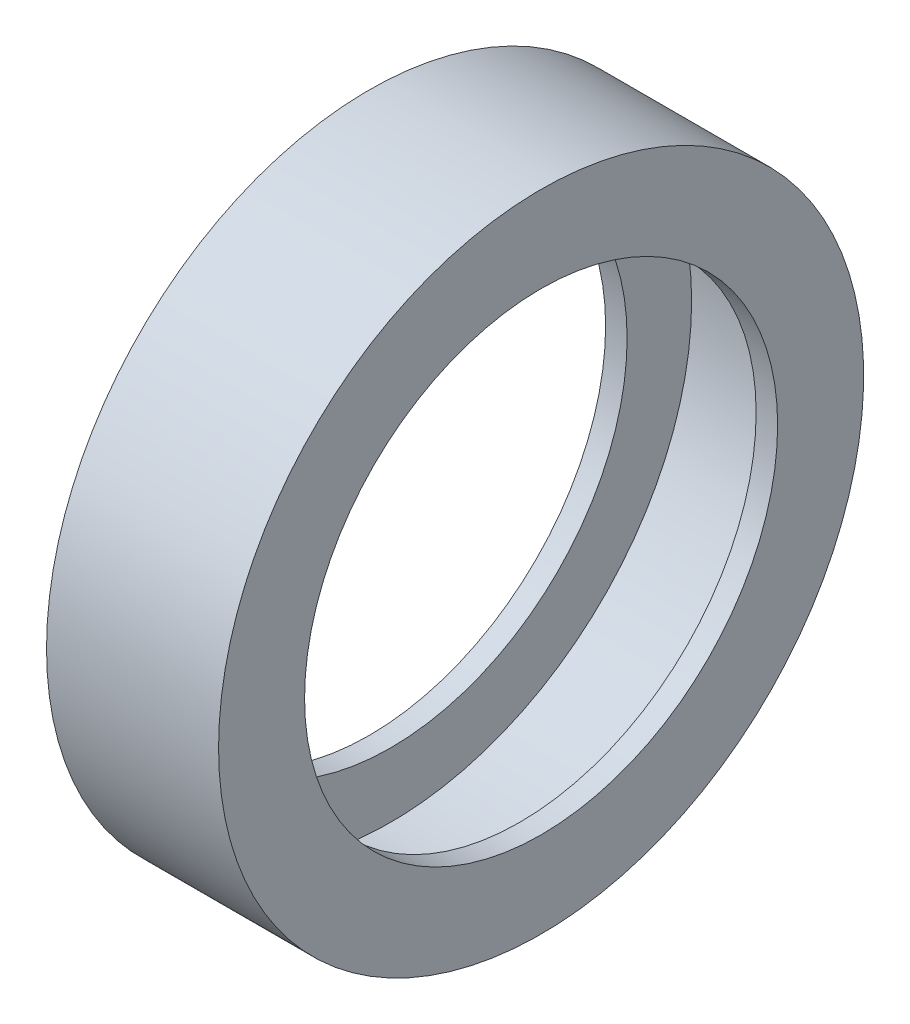
ISO-10303-21;
HEADER;
FILE_DESCRIPTION(('STEP AP214'),'2;1');
FILE_NAME('part.step','',(''),(''),'','','');
FILE_SCHEMA(('AUTOMOTIVE_DESIGN { 1 0 10303 214 1 1 1 1 }'));
ENDSEC;
DATA;
#1=APPLICATION_CONTEXT('core data for automotive mechanical design processes');
#2=APPLICATION_PROTOCOL_DEFINITION('international standard','automotive_design',2000,#1);
#3=PRODUCT_CONTEXT('',#1,'mechanical');
#4=PRODUCT('Part','Part','',(#3));
#5=PRODUCT_RELATED_PRODUCT_CATEGORY('part','',(#4));
#6=PRODUCT_DEFINITION_FORMATION('','',#4);
#7=PRODUCT_DEFINITION_CONTEXT('part definition',#1,'design');
#8=PRODUCT_DEFINITION('design','',#6,#7);
#9=PRODUCT_DEFINITION_SHAPE('','',#8);
#10=(LENGTH_UNIT() NAMED_UNIT(*) SI_UNIT(.MILLI.,.METRE.));
#11=(NAMED_UNIT(*) PLANE_ANGLE_UNIT() SI_UNIT($,.RADIAN.));
#12=(NAMED_UNIT(*) SI_UNIT($,.STERADIAN.) SOLID_ANGLE_UNIT());
#13=UNCERTAINTY_MEASURE_WITH_UNIT(LENGTH_MEASURE(1.E-05),#10,'distance_accuracy_value','');
#14=(GEOMETRIC_REPRESENTATION_CONTEXT(3) GLOBAL_UNCERTAINTY_ASSIGNED_CONTEXT((#13)) GLOBAL_UNIT_ASSIGNED_CONTEXT((#10,
#11,#12)) REPRESENTATION_CONTEXT('',''));
#15=CARTESIAN_POINT('',(0.,0.,0.));
#16=DIRECTION('',(0.,0.,1.));
#17=DIRECTION('',(1.,0.,0.));
#18=AXIS2_PLACEMENT_3D('',#15,#16,#17);
#19=CARTESIAN_POINT('',(-91.9701066716695,0.,0.));
#20=DIRECTION('',(-1.,0.,0.));
#21=DIRECTION('',(0.,0.,1.));
#22=AXIS2_PLACEMENT_3D('',#19,#20,#21);
#23=CYLINDRICAL_SURFACE('',#22,70.);
#24=CARTESIAN_POINT('',(15.,0.,0.));
#25=DIRECTION('',(-1.,0.,0.));
#26=DIRECTION('',(0.,0.,1.));
#27=AXIS2_PLACEMENT_3D('',#24,#25,#26);
#28=CIRCLE('',#27,70.);
#29=CARTESIAN_POINT('',(15.,0.,70.));
#30=VERTEX_POINT('',#29);
#31=EDGE_CURVE('E10',#30,#30,#28,.T.);
#32=ORIENTED_EDGE('',*,*,#31,.F.);
#33=EDGE_LOOP('',(#32));
#34=FACE_BOUND('',#33,.T.);
#35=CARTESIAN_POINT('',(-15.,0.,0.));
#36=DIRECTION('',(-1.,0.,0.));
#37=DIRECTION('',(0.,0.,1.));
#38=AXIS2_PLACEMENT_3D('',#35,#36,#37);
#39=CIRCLE('',#38,70.);
#40=CARTESIAN_POINT('',(-15.,0.,70.));
#41=VERTEX_POINT('',#40);
#42=EDGE_CURVE('E61',#41,#41,#39,.T.);
#43=ORIENTED_EDGE('',*,*,#42,.T.);
#44=EDGE_LOOP('',(#43));
#45=FACE_BOUND('',#44,.T.);
#46=ADVANCED_FACE('F33',(#34,#45),#23,.F.);
#47=CARTESIAN_POINT('',(15.,0.,0.));
#48=DIRECTION('',(1.,0.,0.));
#49=DIRECTION('',(0.,0.,-1.));
#50=AXIS2_PLACEMENT_3D('',#47,#48,#49);
#51=PLANE('',#50);
#52=CARTESIAN_POINT('',(15.,0.,0.));
#53=DIRECTION('',(-1.,0.,0.));
#54=DIRECTION('',(0.,0.,1.));
#55=AXIS2_PLACEMENT_3D('',#52,#53,#54);
#56=CIRCLE('',#55,55.);
#57=CARTESIAN_POINT('',(15.,0.,55.));
#58=VERTEX_POINT('',#57);
#59=EDGE_CURVE('E39',#58,#58,#56,.T.);
#60=ORIENTED_EDGE('',*,*,#59,.F.);
#61=EDGE_LOOP('',(#60));
#62=FACE_BOUND('',#61,.T.);
#63=ORIENTED_EDGE('',*,*,#31,.T.);
#64=EDGE_LOOP('',(#63));
#65=FACE_BOUND('',#64,.T.);
#66=ADVANCED_FACE('F79',(#62,#65),#51,.F.);
#67=CARTESIAN_POINT('',(-91.9701066716695,0.,0.));
#68=DIRECTION('',(-1.,0.,0.));
#69=DIRECTION('',(0.,0.,1.));
#70=AXIS2_PLACEMENT_3D('',#67,#68,#69);
#71=CYLINDRICAL_SURFACE('',#70,55.);
#72=CARTESIAN_POINT('',(20.,0.,0.));
#73=DIRECTION('',(-1.,0.,0.));
#74=DIRECTION('',(0.,0.,1.));
#75=AXIS2_PLACEMENT_3D('',#72,#73,#74);
#76=CIRCLE('',#75,55.);
#77=CARTESIAN_POINT('',(20.,0.,55.));
#78=VERTEX_POINT('',#77);
#79=EDGE_CURVE('E43',#78,#78,#76,.T.);
#80=ORIENTED_EDGE('',*,*,#79,.F.);
#81=EDGE_LOOP('',(#80));
#82=FACE_BOUND('',#81,.T.);
#83=ORIENTED_EDGE('',*,*,#59,.T.);
#84=EDGE_LOOP('',(#83));
#85=FACE_BOUND('',#84,.T.);
#86=ADVANCED_FACE('F77',(#82,#85),#71,.F.);
#87=CARTESIAN_POINT('',(20.,0.,0.));
#88=DIRECTION('',(1.,0.,0.));
#89=DIRECTION('',(0.,0.,-1.));
#90=AXIS2_PLACEMENT_3D('',#87,#88,#89);
#91=PLANE('',#90);
#92=ORIENTED_EDGE('',*,*,#79,.T.);
#93=EDGE_LOOP('',(#92));
#94=FACE_BOUND('',#93,.T.);
#95=CARTESIAN_POINT('',(20.,0.,0.));
#96=DIRECTION('',(-1.,0.,0.));
#97=DIRECTION('',(0.,0.,1.));
#98=AXIS2_PLACEMENT_3D('',#95,#96,#97);
#99=CIRCLE('',#98,75.);
#100=CARTESIAN_POINT('',(20.,0.,75.));
#101=VERTEX_POINT('',#100);
#102=EDGE_CURVE('E47',#101,#101,#99,.T.);
#103=ORIENTED_EDGE('',*,*,#102,.F.);
#104=EDGE_LOOP('',(#103));
#105=FACE_BOUND('',#104,.T.);
#106=ADVANCED_FACE('F88',(#94,#105),#91,.T.);
#107=CARTESIAN_POINT('',(-91.9701066716695,0.,0.));
#108=DIRECTION('',(-1.,0.,0.));
#109=DIRECTION('',(0.,0.,1.));
#110=AXIS2_PLACEMENT_3D('',#107,#108,#109);
#111=CYLINDRICAL_SURFACE('',#110,75.);
#112=ORIENTED_EDGE('',*,*,#102,.T.);
#113=EDGE_LOOP('',(#112));
#114=FACE_BOUND('',#113,.T.);
#115=CARTESIAN_POINT('',(-20.,0.,0.));
#116=DIRECTION('',(-1.,0.,0.));
#117=DIRECTION('',(0.,0.,1.));
#118=AXIS2_PLACEMENT_3D('',#115,#116,#117);
#119=CIRCLE('',#118,75.);
#120=CARTESIAN_POINT('',(-20.,0.,75.));
#121=VERTEX_POINT('',#120);
#122=EDGE_CURVE('E52',#121,#121,#119,.T.);
#123=ORIENTED_EDGE('',*,*,#122,.F.);
#124=EDGE_LOOP('',(#123));
#125=FACE_BOUND('',#124,.T.);
#126=ADVANCED_FACE('F93',(#114,#125),#111,.T.);
#127=CARTESIAN_POINT('',(-20.,0.,0.));
#128=DIRECTION('',(1.,0.,0.));
#129=DIRECTION('',(0.,0.,-1.));
#130=AXIS2_PLACEMENT_3D('',#127,#128,#129);
#131=PLANE('',#130);
#132=CARTESIAN_POINT('',(-20.,0.,0.));
#133=DIRECTION('',(-1.,0.,0.));
#134=DIRECTION('',(0.,0.,1.));
#135=AXIS2_PLACEMENT_3D('',#132,#133,#134);
#136=CIRCLE('',#135,55.);
#137=CARTESIAN_POINT('',(-20.,0.,55.));
#138=VERTEX_POINT('',#137);
#139=EDGE_CURVE('E55',#138,#138,#136,.T.);
#140=ORIENTED_EDGE('',*,*,#139,.F.);
#141=EDGE_LOOP('',(#140));
#142=FACE_BOUND('',#141,.T.);
#143=ORIENTED_EDGE('',*,*,#122,.T.);
#144=EDGE_LOOP('',(#143));
#145=FACE_BOUND('',#144,.T.);
#146=ADVANCED_FACE('F74',(#142,#145),#131,.F.);
#147=CARTESIAN_POINT('',(-15.,0.,0.));
#148=DIRECTION('',(-1.,0.,0.));
#149=DIRECTION('',(0.,0.,1.));
#150=AXIS2_PLACEMENT_3D('',#147,#148,#149);
#151=CIRCLE('',#150,55.);
#152=CARTESIAN_POINT('',(-15.,0.,55.));
#153=VERTEX_POINT('',#152);
#154=EDGE_CURVE('E58',#153,#153,#151,.T.);
#155=ORIENTED_EDGE('',*,*,#154,.F.);
#156=EDGE_LOOP('',(#155));
#157=FACE_BOUND('',#156,.T.);
#158=ORIENTED_EDGE('',*,*,#139,.T.);
#159=EDGE_LOOP('',(#158));
#160=FACE_BOUND('',#159,.T.);
#161=ADVANCED_FACE('F68',(#157,#160),#71,.F.);
#162=CARTESIAN_POINT('',(-15.,0.,0.));
#163=DIRECTION('',(1.,0.,0.));
#164=DIRECTION('',(0.,0.,-1.));
#165=AXIS2_PLACEMENT_3D('',#162,#163,#164);
#166=PLANE('',#165);
#167=ORIENTED_EDGE('',*,*,#154,.T.);
#168=EDGE_LOOP('',(#167));
#169=FACE_BOUND('',#168,.T.);
#170=ORIENTED_EDGE('',*,*,#42,.F.);
#171=EDGE_LOOP('',(#170));
#172=FACE_BOUND('',#171,.T.);
#173=ADVANCED_FACE('F66',(#169,#172),#166,.T.);
#174=CLOSED_SHELL('',(#46,#66,#86,#106,#126,#146,#161,#173));
#175=MANIFOLD_SOLID_BREP('B2',#174);
#176=ADVANCED_BREP_SHAPE_REPRESENTATION('',(#18,#175),#14);
#177=SHAPE_DEFINITION_REPRESENTATION(#9,#176);
ENDSEC;
END-ISO-10303-21;
